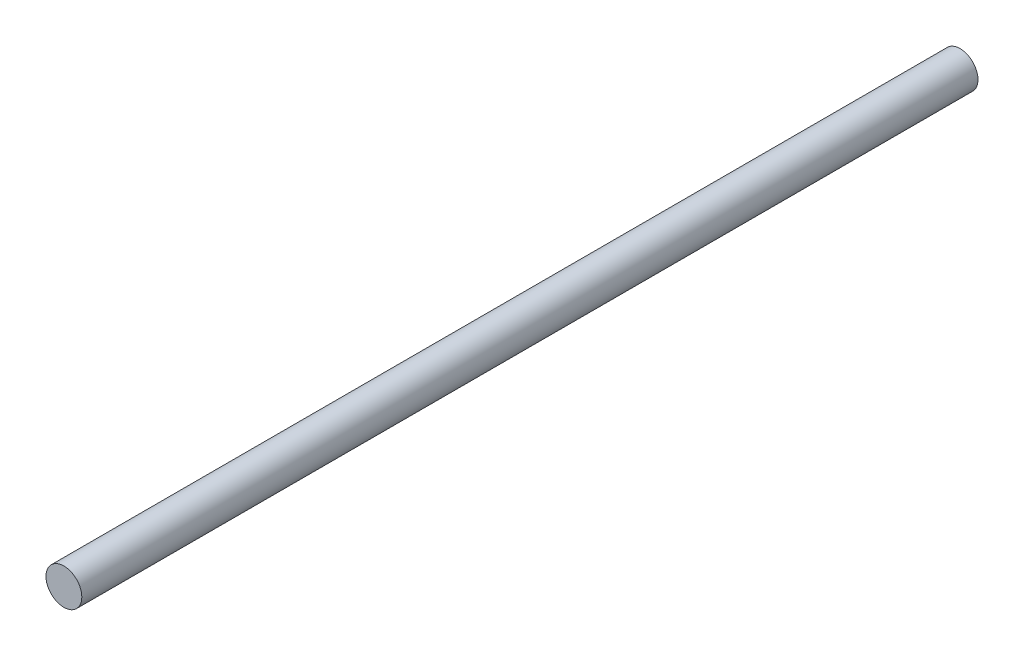
ISO-10303-21;
HEADER;
FILE_DESCRIPTION(('STEP AP214'),'2;1');
FILE_NAME('part.step','',(''),(''),'','','');
FILE_SCHEMA(('AUTOMOTIVE_DESIGN { 1 0 10303 214 1 1 1 1 }'));
ENDSEC;
DATA;
#1=APPLICATION_CONTEXT('core data for automotive mechanical design processes');
#2=APPLICATION_PROTOCOL_DEFINITION('international standard','automotive_design',2000,#1);
#3=PRODUCT_CONTEXT('',#1,'mechanical');
#4=PRODUCT('Part','Part','',(#3));
#5=PRODUCT_RELATED_PRODUCT_CATEGORY('part','',(#4));
#6=PRODUCT_DEFINITION_FORMATION('','',#4);
#7=PRODUCT_DEFINITION_CONTEXT('part definition',#1,'design');
#8=PRODUCT_DEFINITION('design','',#6,#7);
#9=PRODUCT_DEFINITION_SHAPE('','',#8);
#10=(LENGTH_UNIT() NAMED_UNIT(*) SI_UNIT(.MILLI.,.METRE.));
#11=(NAMED_UNIT(*) PLANE_ANGLE_UNIT() SI_UNIT($,.RADIAN.));
#12=(NAMED_UNIT(*) SI_UNIT($,.STERADIAN.) SOLID_ANGLE_UNIT());
#13=UNCERTAINTY_MEASURE_WITH_UNIT(LENGTH_MEASURE(1.E-05),#10,'distance_accuracy_value','');
#14=(GEOMETRIC_REPRESENTATION_CONTEXT(3) GLOBAL_UNCERTAINTY_ASSIGNED_CONTEXT((#13)) GLOBAL_UNIT_ASSIGNED_CONTEXT((#10,
#11,#12)) REPRESENTATION_CONTEXT('',''));
#15=CARTESIAN_POINT('',(0.,0.,0.));
#16=DIRECTION('',(0.,0.,1.));
#17=DIRECTION('',(1.,0.,0.));
#18=AXIS2_PLACEMENT_3D('',#15,#16,#17);
#19=CARTESIAN_POINT('',(0.,0.,200.));
#20=DIRECTION('',(0.,0.,-1.));
#21=DIRECTION('',(-1.,0.,0.));
#22=AXIS2_PLACEMENT_3D('',#19,#20,#21);
#23=CYLINDRICAL_SURFACE('',#22,4.);
#24=CARTESIAN_POINT('',(0.,0.,200.));
#25=DIRECTION('',(0.,0.,1.));
#26=DIRECTION('',(1.,0.,0.));
#27=AXIS2_PLACEMENT_3D('',#24,#25,#26);
#28=CIRCLE('',#27,4.);
#29=CARTESIAN_POINT('',(4.,0.,200.));
#30=VERTEX_POINT('',#29);
#31=EDGE_CURVE('E10',#30,#30,#28,.T.);
#32=ORIENTED_EDGE('',*,*,#31,.F.);
#33=EDGE_LOOP('',(#32));
#34=FACE_BOUND('',#33,.T.);
#35=CARTESIAN_POINT('',(0.,0.,0.));
#36=DIRECTION('',(0.,0.,1.));
#37=DIRECTION('',(1.,0.,0.));
#38=AXIS2_PLACEMENT_3D('',#35,#36,#37);
#39=CIRCLE('',#38,4.);
#40=CARTESIAN_POINT('',(4.,0.,0.));
#41=VERTEX_POINT('',#40);
#42=EDGE_CURVE('E37',#41,#41,#39,.T.);
#43=ORIENTED_EDGE('',*,*,#42,.T.);
#44=EDGE_LOOP('',(#43));
#45=FACE_BOUND('',#44,.T.);
#46=ADVANCED_FACE('F34',(#34,#45),#23,.T.);
#47=CARTESIAN_POINT('',(0.,0.,200.));
#48=DIRECTION('',(0.,0.,1.));
#49=DIRECTION('',(1.,0.,0.));
#50=AXIS2_PLACEMENT_3D('',#47,#48,#49);
#51=PLANE('',#50);
#52=ORIENTED_EDGE('',*,*,#31,.T.);
#53=EDGE_LOOP('',(#52));
#54=FACE_BOUND('',#53,.T.);
#55=ADVANCED_FACE('F49',(#54),#51,.T.);
#56=CARTESIAN_POINT('',(0.,0.,0.));
#57=DIRECTION('',(0.,0.,1.));
#58=DIRECTION('',(1.,0.,0.));
#59=AXIS2_PLACEMENT_3D('',#56,#57,#58);
#60=PLANE('',#59);
#61=ORIENTED_EDGE('',*,*,#42,.F.);
#62=EDGE_LOOP('',(#61));
#63=FACE_BOUND('',#62,.T.);
#64=ADVANCED_FACE('F47',(#63),#60,.F.);
#65=CLOSED_SHELL('',(#46,#55,#64));
#66=MANIFOLD_SOLID_BREP('B2',#65);
#67=ADVANCED_BREP_SHAPE_REPRESENTATION('',(#18,#66),#14);
#68=SHAPE_DEFINITION_REPRESENTATION(#9,#67);
ENDSEC;
END-ISO-10303-21;
